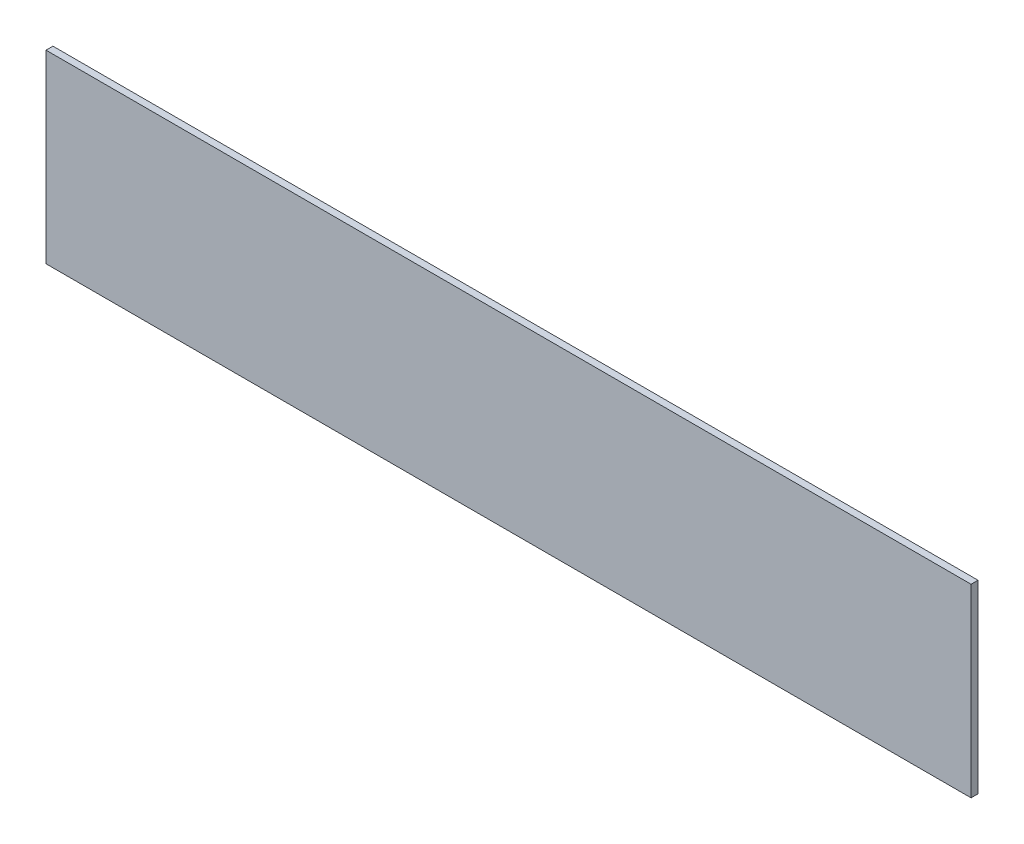
ISO-10303-21;
HEADER;
FILE_DESCRIPTION(('STEP AP214'),'2;1');
FILE_NAME('part.step','',(''),(''),'','','');
FILE_SCHEMA(('AUTOMOTIVE_DESIGN { 1 0 10303 214 1 1 1 1 }'));
ENDSEC;
DATA;
#1=APPLICATION_CONTEXT('core data for automotive mechanical design processes');
#2=APPLICATION_PROTOCOL_DEFINITION('international standard','automotive_design',2000,#1);
#3=PRODUCT_CONTEXT('',#1,'mechanical');
#4=PRODUCT('Part','Part','',(#3));
#5=PRODUCT_RELATED_PRODUCT_CATEGORY('part','',(#4));
#6=PRODUCT_DEFINITION_FORMATION('','',#4);
#7=PRODUCT_DEFINITION_CONTEXT('part definition',#1,'design');
#8=PRODUCT_DEFINITION('design','',#6,#7);
#9=PRODUCT_DEFINITION_SHAPE('','',#8);
#10=(LENGTH_UNIT() NAMED_UNIT(*) SI_UNIT(.MILLI.,.METRE.));
#11=(NAMED_UNIT(*) PLANE_ANGLE_UNIT() SI_UNIT($,.RADIAN.));
#12=(NAMED_UNIT(*) SI_UNIT($,.STERADIAN.) SOLID_ANGLE_UNIT());
#13=UNCERTAINTY_MEASURE_WITH_UNIT(LENGTH_MEASURE(1.E-05),#10,'distance_accuracy_value','');
#14=(GEOMETRIC_REPRESENTATION_CONTEXT(3) GLOBAL_UNCERTAINTY_ASSIGNED_CONTEXT((#13)) GLOBAL_UNIT_ASSIGNED_CONTEXT((#10,
#11,#12)) REPRESENTATION_CONTEXT('',''));
#15=CARTESIAN_POINT('',(0.,0.,0.));
#16=DIRECTION('',(0.,0.,1.));
#17=DIRECTION('',(1.,0.,0.));
#18=AXIS2_PLACEMENT_3D('',#15,#16,#17);
#19=CARTESIAN_POINT('',(635.,127.,9.525));
#20=DIRECTION('',(-1.,0.,0.));
#21=DIRECTION('',(0.,-1.,0.));
#22=AXIS2_PLACEMENT_3D('',#19,#20,#21);
#23=PLANE('',#22);
#24=DIRECTION('',(0.,1.,0.));
#25=VECTOR('',#24,1.);
#26=CARTESIAN_POINT('',(635.,127.,0.));
#27=LINE('',#26,#25);
#28=CARTESIAN_POINT('',(635.,-127.,0.));
#29=VERTEX_POINT('',#28);
#30=CARTESIAN_POINT('',(635.,127.,0.));
#31=VERTEX_POINT('',#30);
#32=EDGE_CURVE('E107',#29,#31,#27,.T.);
#33=ORIENTED_EDGE('',*,*,#32,.T.);
#34=DIRECTION('',(0.,0.,-1.));
#35=VECTOR('',#34,1.);
#36=CARTESIAN_POINT('',(635.,127.,9.525));
#37=LINE('',#36,#35);
#38=CARTESIAN_POINT('',(635.,127.,9.525));
#39=VERTEX_POINT('',#38);
#40=EDGE_CURVE('E11',#39,#31,#37,.T.);
#41=ORIENTED_EDGE('',*,*,#40,.F.);
#42=DIRECTION('',(0.,1.,0.));
#43=VECTOR('',#42,1.);
#44=CARTESIAN_POINT('',(635.,127.,9.525));
#45=LINE('',#44,#43);
#46=CARTESIAN_POINT('',(635.,-127.,9.525));
#47=VERTEX_POINT('',#46);
#48=EDGE_CURVE('E91',#47,#39,#45,.T.);
#49=ORIENTED_EDGE('',*,*,#48,.F.);
#50=DIRECTION('',(0.,0.,-1.));
#51=VECTOR('',#50,1.);
#52=CARTESIAN_POINT('',(635.,-127.,9.525));
#53=LINE('',#52,#51);
#54=EDGE_CURVE('E103',#47,#29,#53,.T.);
#55=ORIENTED_EDGE('',*,*,#54,.T.);
#56=EDGE_LOOP('',(#33,#41,#49,#55));
#57=FACE_BOUND('',#56,.T.);
#58=ADVANCED_FACE('F39',(#57),#23,.F.);
#59=CARTESIAN_POINT('',(-635.,127.,9.525));
#60=DIRECTION('',(0.,-1.,0.));
#61=DIRECTION('',(0.,0.,-1.));
#62=AXIS2_PLACEMENT_3D('',#59,#60,#61);
#63=PLANE('',#62);
#64=DIRECTION('',(-1.,0.,0.));
#65=VECTOR('',#64,1.);
#66=CARTESIAN_POINT('',(-635.,127.,0.));
#67=LINE('',#66,#65);
#68=CARTESIAN_POINT('',(-635.,127.,0.));
#69=VERTEX_POINT('',#68);
#70=EDGE_CURVE('E96',#31,#69,#67,.T.);
#71=ORIENTED_EDGE('',*,*,#70,.T.);
#72=DIRECTION('',(0.,0.,-1.));
#73=VECTOR('',#72,1.);
#74=CARTESIAN_POINT('',(-635.,127.,9.525));
#75=LINE('',#74,#73);
#76=CARTESIAN_POINT('',(-635.,127.,9.525));
#77=VERTEX_POINT('',#76);
#78=EDGE_CURVE('E48',#77,#69,#75,.T.);
#79=ORIENTED_EDGE('',*,*,#78,.F.);
#80=DIRECTION('',(-1.,0.,0.));
#81=VECTOR('',#80,1.);
#82=CARTESIAN_POINT('',(-635.,127.,9.525));
#83=LINE('',#82,#81);
#84=EDGE_CURVE('E86',#39,#77,#83,.T.);
#85=ORIENTED_EDGE('',*,*,#84,.F.);
#86=ORIENTED_EDGE('',*,*,#40,.T.);
#87=EDGE_LOOP('',(#71,#79,#85,#86));
#88=FACE_BOUND('',#87,.T.);
#89=ADVANCED_FACE('F95',(#88),#63,.F.);
#90=CARTESIAN_POINT('',(-635.,127.,9.525));
#91=DIRECTION('',(1.,0.,0.));
#92=DIRECTION('',(0.,0.,-1.));
#93=AXIS2_PLACEMENT_3D('',#90,#91,#92);
#94=PLANE('',#93);
#95=DIRECTION('',(0.,-1.,0.));
#96=VECTOR('',#95,1.);
#97=CARTESIAN_POINT('',(-635.,127.,0.));
#98=LINE('',#97,#96);
#99=CARTESIAN_POINT('',(-635.,-127.,0.));
#100=VERTEX_POINT('',#99);
#101=EDGE_CURVE('E73',#69,#100,#98,.T.);
#102=ORIENTED_EDGE('',*,*,#101,.T.);
#103=DIRECTION('',(0.,0.,-1.));
#104=VECTOR('',#103,1.);
#105=CARTESIAN_POINT('',(-635.,-127.,9.525));
#106=LINE('',#105,#104);
#107=CARTESIAN_POINT('',(-635.,-127.,9.525));
#108=VERTEX_POINT('',#107);
#109=EDGE_CURVE('E98',#108,#100,#106,.T.);
#110=ORIENTED_EDGE('',*,*,#109,.F.);
#111=DIRECTION('',(0.,-1.,0.));
#112=VECTOR('',#111,1.);
#113=CARTESIAN_POINT('',(-635.,127.,9.525));
#114=LINE('',#113,#112);
#115=EDGE_CURVE('E89',#77,#108,#114,.T.);
#116=ORIENTED_EDGE('',*,*,#115,.F.);
#117=ORIENTED_EDGE('',*,*,#78,.T.);
#118=EDGE_LOOP('',(#102,#110,#116,#117));
#119=FACE_BOUND('',#118,.T.);
#120=ADVANCED_FACE('F99',(#119),#94,.F.);
#121=CARTESIAN_POINT('',(-635.,-127.,9.525));
#122=DIRECTION('',(0.,1.,0.));
#123=DIRECTION('',(0.,0.,1.));
#124=AXIS2_PLACEMENT_3D('',#121,#122,#123);
#125=PLANE('',#124);
#126=DIRECTION('',(1.,0.,0.));
#127=VECTOR('',#126,1.);
#128=CARTESIAN_POINT('',(-635.,-127.,0.));
#129=LINE('',#128,#127);
#130=EDGE_CURVE('E79',#100,#29,#129,.T.);
#131=ORIENTED_EDGE('',*,*,#130,.T.);
#132=ORIENTED_EDGE('',*,*,#54,.F.);
#133=DIRECTION('',(1.,0.,0.));
#134=VECTOR('',#133,1.);
#135=CARTESIAN_POINT('',(-635.,-127.,9.525));
#136=LINE('',#135,#134);
#137=EDGE_CURVE('E56',#108,#47,#136,.T.);
#138=ORIENTED_EDGE('',*,*,#137,.F.);
#139=ORIENTED_EDGE('',*,*,#109,.T.);
#140=EDGE_LOOP('',(#131,#132,#138,#139));
#141=FACE_BOUND('',#140,.T.);
#142=ADVANCED_FACE('F120',(#141),#125,.F.);
#143=CARTESIAN_POINT('',(0.,0.,9.525));
#144=DIRECTION('',(0.,0.,1.));
#145=DIRECTION('',(1.,0.,0.));
#146=AXIS2_PLACEMENT_3D('',#143,#144,#145);
#147=PLANE('',#146);
#148=ORIENTED_EDGE('',*,*,#48,.T.);
#149=ORIENTED_EDGE('',*,*,#84,.T.);
#150=ORIENTED_EDGE('',*,*,#115,.T.);
#151=ORIENTED_EDGE('',*,*,#137,.T.);
#152=EDGE_LOOP('',(#148,#149,#150,#151));
#153=FACE_BOUND('',#152,.T.);
#154=ADVANCED_FACE('F87',(#153),#147,.T.);
#155=CARTESIAN_POINT('',(0.,0.,0.));
#156=DIRECTION('',(0.,0.,1.));
#157=DIRECTION('',(1.,0.,0.));
#158=AXIS2_PLACEMENT_3D('',#155,#156,#157);
#159=PLANE('',#158);
#160=ORIENTED_EDGE('',*,*,#32,.F.);
#161=ORIENTED_EDGE('',*,*,#130,.F.);
#162=ORIENTED_EDGE('',*,*,#101,.F.);
#163=ORIENTED_EDGE('',*,*,#70,.F.);
#164=EDGE_LOOP('',(#160,#161,#162,#163));
#165=FACE_BOUND('',#164,.T.);
#166=ADVANCED_FACE('F123',(#165),#159,.F.);
#167=CLOSED_SHELL('',(#58,#89,#120,#142,#154,#166));
#168=MANIFOLD_SOLID_BREP('B2',#167);
#169=ADVANCED_BREP_SHAPE_REPRESENTATION('',(#18,#168),#14);
#170=SHAPE_DEFINITION_REPRESENTATION(#9,#169);
ENDSEC;
END-ISO-10303-21;
